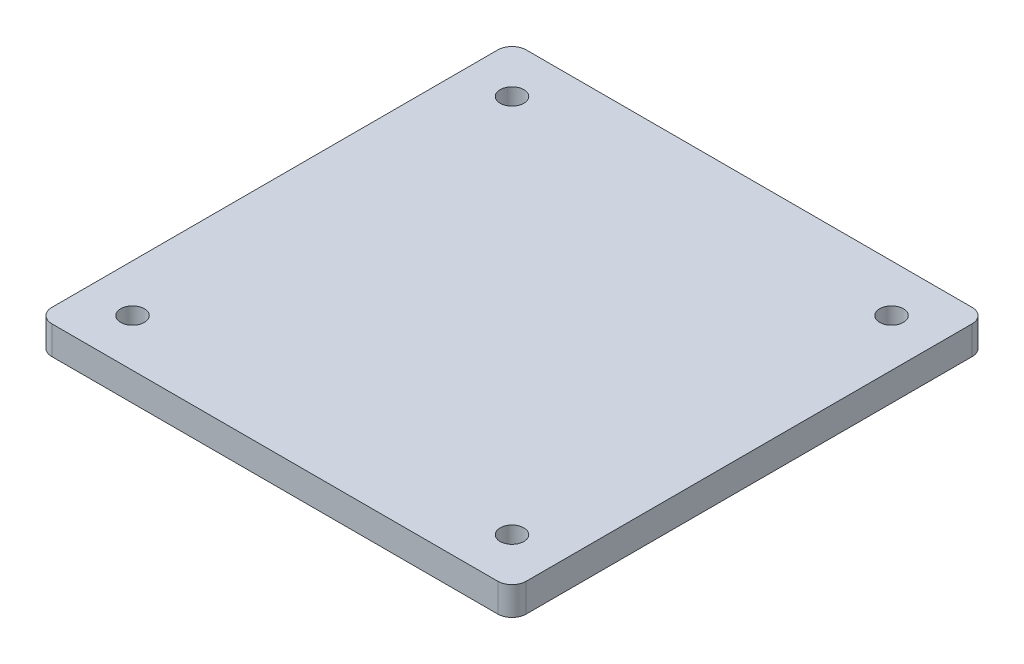
ISO-10303-21;
HEADER;
FILE_DESCRIPTION(('STEP AP214'),'2;1');
FILE_NAME('part.step','',(''),(''),'','','');
FILE_SCHEMA(('AUTOMOTIVE_DESIGN { 1 0 10303 214 1 1 1 1 }'));
ENDSEC;
DATA;
#1=APPLICATION_CONTEXT('core data for automotive mechanical design processes');
#2=APPLICATION_PROTOCOL_DEFINITION('international standard','automotive_design',2000,#1);
#3=PRODUCT_CONTEXT('',#1,'mechanical');
#4=PRODUCT('Part','Part','',(#3));
#5=PRODUCT_RELATED_PRODUCT_CATEGORY('part','',(#4));
#6=PRODUCT_DEFINITION_FORMATION('','',#4);
#7=PRODUCT_DEFINITION_CONTEXT('part definition',#1,'design');
#8=PRODUCT_DEFINITION('design','',#6,#7);
#9=PRODUCT_DEFINITION_SHAPE('','',#8);
#10=(LENGTH_UNIT() NAMED_UNIT(*) SI_UNIT(.MILLI.,.METRE.));
#11=(NAMED_UNIT(*) PLANE_ANGLE_UNIT() SI_UNIT($,.RADIAN.));
#12=(NAMED_UNIT(*) SI_UNIT($,.STERADIAN.) SOLID_ANGLE_UNIT());
#13=UNCERTAINTY_MEASURE_WITH_UNIT(LENGTH_MEASURE(1.E-05),#10,'distance_accuracy_value','');
#14=(GEOMETRIC_REPRESENTATION_CONTEXT(3) GLOBAL_UNCERTAINTY_ASSIGNED_CONTEXT((#13)) GLOBAL_UNIT_ASSIGNED_CONTEXT((#10,
#11,#12)) REPRESENTATION_CONTEXT('',''));
#15=CARTESIAN_POINT('',(0.,0.,0.));
#16=DIRECTION('',(0.,0.,1.));
#17=DIRECTION('',(1.,0.,0.));
#18=AXIS2_PLACEMENT_3D('',#15,#16,#17);
#19=CARTESIAN_POINT('',(0.,6.,0.));
#20=DIRECTION('',(0.,1.,0.));
#21=DIRECTION('',(0.,0.,1.));
#22=AXIS2_PLACEMENT_3D('',#19,#20,#21);
#23=PLANE('',#22);
#24=CARTESIAN_POINT('',(80.0000000000009,6.,80.));
#25=DIRECTION('',(0.,1.,0.));
#26=DIRECTION('',(0.,0.,1.));
#27=AXIS2_PLACEMENT_3D('',#24,#25,#26);
#28=CIRCLE('',#27,2.50000000000001);
#29=CARTESIAN_POINT('',(80.0000000000009,6.,82.5));
#30=VERTEX_POINT('',#29);
#31=EDGE_CURVE('E185',#30,#30,#28,.T.);
#32=ORIENTED_EDGE('',*,*,#31,.F.);
#33=EDGE_LOOP('',(#32));
#34=FACE_BOUND('',#33,.T.);
#35=CARTESIAN_POINT('',(0.,6.,0.));
#36=DIRECTION('',(0.,1.,0.));
#37=DIRECTION('',(0.,0.,1.));
#38=AXIS2_PLACEMENT_3D('',#35,#36,#37);
#39=CIRCLE('',#38,2.5);
#40=CARTESIAN_POINT('',(0.,6.,2.5));
#41=VERTEX_POINT('',#40);
#42=EDGE_CURVE('E127',#41,#41,#39,.T.);
#43=ORIENTED_EDGE('',*,*,#42,.F.);
#44=EDGE_LOOP('',(#43));
#45=FACE_BOUND('',#44,.T.);
#46=DIRECTION('',(-1.,0.,0.));
#47=VECTOR('',#46,1.);
#48=CARTESIAN_POINT('',(-9.99999999999916,6.,-10.));
#49=LINE('',#48,#47);
#50=CARTESIAN_POINT('',(87.0000000000008,6.,-10.));
#51=VERTEX_POINT('',#50);
#52=CARTESIAN_POINT('',(-6.99999999999916,6.,-10.));
#53=VERTEX_POINT('',#52);
#54=EDGE_CURVE('E136',#51,#53,#49,.T.);
#55=ORIENTED_EDGE('',*,*,#54,.T.);
#56=CARTESIAN_POINT('',(-6.99999999999916,6.,-7.));
#57=DIRECTION('',(0.,1.,0.));
#58=DIRECTION('',(0.,0.,1.));
#59=AXIS2_PLACEMENT_3D('',#56,#57,#58);
#60=CIRCLE('',#59,3.);
#61=CARTESIAN_POINT('',(-9.99999999999916,6.,-7.));
#62=VERTEX_POINT('',#61);
#63=EDGE_CURVE('E155',#53,#62,#60,.T.);
#64=ORIENTED_EDGE('',*,*,#63,.T.);
#65=DIRECTION('',(0.,0.,1.));
#66=VECTOR('',#65,1.);
#67=CARTESIAN_POINT('',(-9.99999999999916,6.,-10.));
#68=LINE('',#67,#66);
#69=CARTESIAN_POINT('',(-9.99999999999916,6.,87.));
#70=VERTEX_POINT('',#69);
#71=EDGE_CURVE('E119',#62,#70,#68,.T.);
#72=ORIENTED_EDGE('',*,*,#71,.T.);
#73=CARTESIAN_POINT('',(-6.99999999999916,6.,87.));
#74=DIRECTION('',(0.,1.,0.));
#75=DIRECTION('',(0.,0.,1.));
#76=AXIS2_PLACEMENT_3D('',#73,#74,#75);
#77=CIRCLE('',#76,3.);
#78=CARTESIAN_POINT('',(-6.99999999999916,6.,90.));
#79=VERTEX_POINT('',#78);
#80=EDGE_CURVE('E153',#70,#79,#77,.T.);
#81=ORIENTED_EDGE('',*,*,#80,.T.);
#82=DIRECTION('',(1.,0.,0.));
#83=VECTOR('',#82,1.);
#84=CARTESIAN_POINT('',(-9.99999999999916,6.,90.));
#85=LINE('',#84,#83);
#86=CARTESIAN_POINT('',(87.0000000000009,6.,90.));
#87=VERTEX_POINT('',#86);
#88=EDGE_CURVE('E175',#79,#87,#85,.T.);
#89=ORIENTED_EDGE('',*,*,#88,.T.);
#90=CARTESIAN_POINT('',(87.0000000000009,6.,87.));
#91=DIRECTION('',(0.,1.,0.));
#92=DIRECTION('',(0.,0.,1.));
#93=AXIS2_PLACEMENT_3D('',#90,#91,#92);
#94=CIRCLE('',#93,3.);
#95=CARTESIAN_POINT('',(90.0000000000009,6.,87.));
#96=VERTEX_POINT('',#95);
#97=EDGE_CURVE('E54',#87,#96,#94,.T.);
#98=ORIENTED_EDGE('',*,*,#97,.T.);
#99=DIRECTION('',(0.,0.,-1.));
#100=VECTOR('',#99,1.);
#101=CARTESIAN_POINT('',(90.0000000000008,6.,-10.));
#102=LINE('',#101,#100);
#103=CARTESIAN_POINT('',(90.0000000000008,6.,-7.));
#104=VERTEX_POINT('',#103);
#105=EDGE_CURVE('E165',#96,#104,#102,.T.);
#106=ORIENTED_EDGE('',*,*,#105,.T.);
#107=CARTESIAN_POINT('',(87.0000000000008,6.,-7.));
#108=DIRECTION('',(0.,1.,0.));
#109=DIRECTION('',(0.,0.,1.));
#110=AXIS2_PLACEMENT_3D('',#107,#108,#109);
#111=CIRCLE('',#110,3.);
#112=EDGE_CURVE('E151',#104,#51,#111,.T.);
#113=ORIENTED_EDGE('',*,*,#112,.T.);
#114=EDGE_LOOP('',(#55,#64,#72,#81,#89,#98,#106,#113));
#115=FACE_BOUND('',#114,.T.);
#116=CARTESIAN_POINT('',(80.,6.,0.));
#117=DIRECTION('',(0.,1.,0.));
#118=DIRECTION('',(0.,0.,1.));
#119=AXIS2_PLACEMENT_3D('',#116,#117,#118);
#120=CIRCLE('',#119,2.50000000000001);
#121=CARTESIAN_POINT('',(80.,6.,2.50000000000001));
#122=VERTEX_POINT('',#121);
#123=EDGE_CURVE('E180',#122,#122,#120,.T.);
#124=ORIENTED_EDGE('',*,*,#123,.F.);
#125=EDGE_LOOP('',(#124));
#126=FACE_BOUND('',#125,.T.);
#127=CARTESIAN_POINT('',(8.37956007813608E-13,6.,80.));
#128=DIRECTION('',(0.,1.,0.));
#129=DIRECTION('',(0.,0.,1.));
#130=AXIS2_PLACEMENT_3D('',#127,#128,#129);
#131=CIRCLE('',#130,2.5);
#132=CARTESIAN_POINT('',(8.37956007813608E-13,6.,82.5));
#133=VERTEX_POINT('',#132);
#134=EDGE_CURVE('E191',#133,#133,#131,.T.);
#135=ORIENTED_EDGE('',*,*,#134,.F.);
#136=EDGE_LOOP('',(#135));
#137=FACE_BOUND('',#136,.T.);
#138=ADVANCED_FACE('F34',(#34,#45,#115,#126,#137),#23,.T.);
#139=CARTESIAN_POINT('',(0.,0.,0.));
#140=DIRECTION('',(0.,1.,0.));
#141=DIRECTION('',(0.,0.,1.));
#142=AXIS2_PLACEMENT_3D('',#139,#140,#141);
#143=PLANE('',#142);
#144=CARTESIAN_POINT('',(80.0000000000009,0.,80.));
#145=DIRECTION('',(0.,1.,0.));
#146=DIRECTION('',(0.,0.,1.));
#147=AXIS2_PLACEMENT_3D('',#144,#145,#146);
#148=CIRCLE('',#147,2.50000000000001);
#149=CARTESIAN_POINT('',(80.0000000000009,0.,82.5));
#150=VERTEX_POINT('',#149);
#151=EDGE_CURVE('E188',#150,#150,#148,.T.);
#152=ORIENTED_EDGE('',*,*,#151,.T.);
#153=EDGE_LOOP('',(#152));
#154=FACE_BOUND('',#153,.T.);
#155=CARTESIAN_POINT('',(0.,0.,0.));
#156=DIRECTION('',(0.,1.,0.));
#157=DIRECTION('',(0.,0.,1.));
#158=AXIS2_PLACEMENT_3D('',#155,#156,#157);
#159=CIRCLE('',#158,2.5);
#160=CARTESIAN_POINT('',(0.,0.,2.5));
#161=VERTEX_POINT('',#160);
#162=EDGE_CURVE('E133',#161,#161,#159,.T.);
#163=ORIENTED_EDGE('',*,*,#162,.T.);
#164=EDGE_LOOP('',(#163));
#165=FACE_BOUND('',#164,.T.);
#166=DIRECTION('',(0.,0.,1.));
#167=VECTOR('',#166,1.);
#168=CARTESIAN_POINT('',(-9.99999999999916,0.,-10.));
#169=LINE('',#168,#167);
#170=CARTESIAN_POINT('',(-9.99999999999916,0.,-7.));
#171=VERTEX_POINT('',#170);
#172=CARTESIAN_POINT('',(-9.99999999999916,0.,87.));
#173=VERTEX_POINT('',#172);
#174=EDGE_CURVE('E116',#171,#173,#169,.T.);
#175=ORIENTED_EDGE('',*,*,#174,.F.);
#176=CARTESIAN_POINT('',(-6.99999999999916,0.,-7.));
#177=DIRECTION('',(0.,1.,0.));
#178=DIRECTION('',(0.,0.,1.));
#179=AXIS2_PLACEMENT_3D('',#176,#177,#178);
#180=CIRCLE('',#179,3.);
#181=CARTESIAN_POINT('',(-6.99999999999916,0.,-10.));
#182=VERTEX_POINT('',#181);
#183=EDGE_CURVE('E99',#171,#182,#180,.F.);
#184=ORIENTED_EDGE('',*,*,#183,.T.);
#185=DIRECTION('',(-1.,0.,0.));
#186=VECTOR('',#185,1.);
#187=CARTESIAN_POINT('',(-9.99999999999916,0.,-10.));
#188=LINE('',#187,#186);
#189=CARTESIAN_POINT('',(87.0000000000008,0.,-10.));
#190=VERTEX_POINT('',#189);
#191=EDGE_CURVE('E140',#190,#182,#188,.T.);
#192=ORIENTED_EDGE('',*,*,#191,.F.);
#193=CARTESIAN_POINT('',(87.0000000000008,0.,-7.));
#194=DIRECTION('',(0.,1.,0.));
#195=DIRECTION('',(0.,0.,1.));
#196=AXIS2_PLACEMENT_3D('',#193,#194,#195);
#197=CIRCLE('',#196,3.);
#198=CARTESIAN_POINT('',(90.0000000000008,0.,-7.));
#199=VERTEX_POINT('',#198);
#200=EDGE_CURVE('E144',#190,#199,#197,.F.);
#201=ORIENTED_EDGE('',*,*,#200,.T.);
#202=DIRECTION('',(0.,0.,-1.));
#203=VECTOR('',#202,1.);
#204=CARTESIAN_POINT('',(90.0000000000008,0.,-10.));
#205=LINE('',#204,#203);
#206=CARTESIAN_POINT('',(90.0000000000009,0.,87.));
#207=VERTEX_POINT('',#206);
#208=EDGE_CURVE('E130',#207,#199,#205,.T.);
#209=ORIENTED_EDGE('',*,*,#208,.F.);
#210=CARTESIAN_POINT('',(87.0000000000009,0.,87.));
#211=DIRECTION('',(0.,1.,0.));
#212=DIRECTION('',(0.,0.,1.));
#213=AXIS2_PLACEMENT_3D('',#210,#211,#212);
#214=CIRCLE('',#213,3.);
#215=CARTESIAN_POINT('',(87.0000000000009,0.,90.));
#216=VERTEX_POINT('',#215);
#217=EDGE_CURVE('E120',#207,#216,#214,.F.);
#218=ORIENTED_EDGE('',*,*,#217,.T.);
#219=DIRECTION('',(1.,0.,0.));
#220=VECTOR('',#219,1.);
#221=CARTESIAN_POINT('',(-9.99999999999916,0.,90.));
#222=LINE('',#221,#220);
#223=CARTESIAN_POINT('',(-6.99999999999916,0.,90.));
#224=VERTEX_POINT('',#223);
#225=EDGE_CURVE('E126',#224,#216,#222,.T.);
#226=ORIENTED_EDGE('',*,*,#225,.F.);
#227=CARTESIAN_POINT('',(-6.99999999999916,0.,87.));
#228=DIRECTION('',(0.,1.,0.));
#229=DIRECTION('',(0.,0.,1.));
#230=AXIS2_PLACEMENT_3D('',#227,#228,#229);
#231=CIRCLE('',#230,3.);
#232=EDGE_CURVE('E110',#224,#173,#231,.F.);
#233=ORIENTED_EDGE('',*,*,#232,.T.);
#234=EDGE_LOOP('',(#175,#184,#192,#201,#209,#218,#226,#233));
#235=FACE_BOUND('',#234,.T.);
#236=CARTESIAN_POINT('',(80.,0.,0.));
#237=DIRECTION('',(0.,1.,0.));
#238=DIRECTION('',(0.,0.,1.));
#239=AXIS2_PLACEMENT_3D('',#236,#237,#238);
#240=CIRCLE('',#239,2.50000000000001);
#241=CARTESIAN_POINT('',(80.,0.,2.50000000000001));
#242=VERTEX_POINT('',#241);
#243=EDGE_CURVE('E182',#242,#242,#240,.T.);
#244=ORIENTED_EDGE('',*,*,#243,.T.);
#245=EDGE_LOOP('',(#244));
#246=FACE_BOUND('',#245,.T.);
#247=CARTESIAN_POINT('',(8.37956007813608E-13,0.,80.));
#248=DIRECTION('',(0.,1.,0.));
#249=DIRECTION('',(0.,0.,1.));
#250=AXIS2_PLACEMENT_3D('',#247,#248,#249);
#251=CIRCLE('',#250,2.5);
#252=CARTESIAN_POINT('',(8.37956007813608E-13,0.,82.5));
#253=VERTEX_POINT('',#252);
#254=EDGE_CURVE('E194',#253,#253,#251,.T.);
#255=ORIENTED_EDGE('',*,*,#254,.T.);
#256=EDGE_LOOP('',(#255));
#257=FACE_BOUND('',#256,.T.);
#258=ADVANCED_FACE('F123',(#154,#165,#235,#246,#257),#143,.F.);
#259=CARTESIAN_POINT('',(-9.99999999999916,6.,-10.));
#260=DIRECTION('',(1.,0.,0.));
#261=DIRECTION('',(0.,0.,-1.));
#262=AXIS2_PLACEMENT_3D('',#259,#260,#261);
#263=PLANE('',#262);
#264=ORIENTED_EDGE('',*,*,#71,.F.);
#265=DIRECTION('',(0.,-1.,0.));
#266=VECTOR('',#265,1.);
#267=CARTESIAN_POINT('',(-9.99999999999916,6.,-7.));
#268=LINE('',#267,#266);
#269=EDGE_CURVE('E103',#62,#171,#268,.T.);
#270=ORIENTED_EDGE('',*,*,#269,.T.);
#271=ORIENTED_EDGE('',*,*,#174,.T.);
#272=DIRECTION('',(0.,-1.,0.));
#273=VECTOR('',#272,1.);
#274=CARTESIAN_POINT('',(-9.99999999999916,6.,87.));
#275=LINE('',#274,#273);
#276=EDGE_CURVE('E121',#173,#70,#275,.F.);
#277=ORIENTED_EDGE('',*,*,#276,.T.);
#278=EDGE_LOOP('',(#264,#270,#271,#277));
#279=FACE_BOUND('',#278,.T.);
#280=ADVANCED_FACE('F115',(#279),#263,.F.);
#281=CARTESIAN_POINT('',(-9.99999999999916,6.,90.));
#282=DIRECTION('',(0.,0.,-1.));
#283=DIRECTION('',(-1.,0.,0.));
#284=AXIS2_PLACEMENT_3D('',#281,#282,#283);
#285=PLANE('',#284);
#286=ORIENTED_EDGE('',*,*,#88,.F.);
#287=DIRECTION('',(0.,-1.,0.));
#288=VECTOR('',#287,1.);
#289=CARTESIAN_POINT('',(-6.99999999999916,6.,90.));
#290=LINE('',#289,#288);
#291=EDGE_CURVE('E159',#79,#224,#290,.T.);
#292=ORIENTED_EDGE('',*,*,#291,.T.);
#293=ORIENTED_EDGE('',*,*,#225,.T.);
#294=DIRECTION('',(0.,-1.,0.));
#295=VECTOR('',#294,1.);
#296=CARTESIAN_POINT('',(87.0000000000009,6.,90.));
#297=LINE('',#296,#295);
#298=EDGE_CURVE('E157',#216,#87,#297,.F.);
#299=ORIENTED_EDGE('',*,*,#298,.T.);
#300=EDGE_LOOP('',(#286,#292,#293,#299));
#301=FACE_BOUND('',#300,.T.);
#302=ADVANCED_FACE('F221',(#301),#285,.F.);
#303=CARTESIAN_POINT('',(90.0000000000008,6.,-10.));
#304=DIRECTION('',(-1.,0.,0.));
#305=DIRECTION('',(0.,0.,1.));
#306=AXIS2_PLACEMENT_3D('',#303,#304,#305);
#307=PLANE('',#306);
#308=ORIENTED_EDGE('',*,*,#208,.T.);
#309=DIRECTION('',(0.,-1.,0.));
#310=VECTOR('',#309,1.);
#311=CARTESIAN_POINT('',(90.0000000000008,6.,-7.));
#312=LINE('',#311,#310);
#313=EDGE_CURVE('E11',#199,#104,#312,.F.);
#314=ORIENTED_EDGE('',*,*,#313,.T.);
#315=ORIENTED_EDGE('',*,*,#105,.F.);
#316=DIRECTION('',(0.,-1.,0.));
#317=VECTOR('',#316,1.);
#318=CARTESIAN_POINT('',(90.0000000000009,6.,87.));
#319=LINE('',#318,#317);
#320=EDGE_CURVE('E42',#96,#207,#319,.T.);
#321=ORIENTED_EDGE('',*,*,#320,.T.);
#322=EDGE_LOOP('',(#308,#314,#315,#321));
#323=FACE_BOUND('',#322,.T.);
#324=ADVANCED_FACE('F164',(#323),#307,.F.);
#325=CARTESIAN_POINT('',(-9.99999999999916,6.,-10.));
#326=DIRECTION('',(0.,0.,1.));
#327=DIRECTION('',(1.,0.,0.));
#328=AXIS2_PLACEMENT_3D('',#325,#326,#327);
#329=PLANE('',#328);
#330=ORIENTED_EDGE('',*,*,#191,.T.);
#331=DIRECTION('',(0.,-1.,0.));
#332=VECTOR('',#331,1.);
#333=CARTESIAN_POINT('',(-6.99999999999916,6.,-10.));
#334=LINE('',#333,#332);
#335=EDGE_CURVE('E104',#182,#53,#334,.F.);
#336=ORIENTED_EDGE('',*,*,#335,.T.);
#337=ORIENTED_EDGE('',*,*,#54,.F.);
#338=DIRECTION('',(0.,-1.,0.));
#339=VECTOR('',#338,1.);
#340=CARTESIAN_POINT('',(87.0000000000008,6.,-10.));
#341=LINE('',#340,#339);
#342=EDGE_CURVE('E109',#51,#190,#341,.T.);
#343=ORIENTED_EDGE('',*,*,#342,.T.);
#344=EDGE_LOOP('',(#330,#336,#337,#343));
#345=FACE_BOUND('',#344,.T.);
#346=ADVANCED_FACE('F173',(#345),#329,.F.);
#347=CARTESIAN_POINT('',(0.,6.,0.));
#348=DIRECTION('',(0.,-1.,0.));
#349=DIRECTION('',(0.,0.,-1.));
#350=AXIS2_PLACEMENT_3D('',#347,#348,#349);
#351=CYLINDRICAL_SURFACE('',#350,2.5);
#352=ORIENTED_EDGE('',*,*,#42,.T.);
#353=EDGE_LOOP('',(#352));
#354=FACE_BOUND('',#353,.T.);
#355=ORIENTED_EDGE('',*,*,#162,.F.);
#356=EDGE_LOOP('',(#355));
#357=FACE_BOUND('',#356,.T.);
#358=ADVANCED_FACE('F214',(#354,#357),#351,.F.);
#359=CARTESIAN_POINT('',(80.,6.,0.));
#360=DIRECTION('',(0.,-1.,0.));
#361=DIRECTION('',(0.,0.,-1.));
#362=AXIS2_PLACEMENT_3D('',#359,#360,#361);
#363=CYLINDRICAL_SURFACE('',#362,2.50000000000001);
#364=ORIENTED_EDGE('',*,*,#123,.T.);
#365=EDGE_LOOP('',(#364));
#366=FACE_BOUND('',#365,.T.);
#367=ORIENTED_EDGE('',*,*,#243,.F.);
#368=EDGE_LOOP('',(#367));
#369=FACE_BOUND('',#368,.T.);
#370=ADVANCED_FACE('F245',(#366,#369),#363,.F.);
#371=CARTESIAN_POINT('',(80.0000000000009,6.,80.));
#372=DIRECTION('',(0.,-1.,0.));
#373=DIRECTION('',(0.,0.,-1.));
#374=AXIS2_PLACEMENT_3D('',#371,#372,#373);
#375=CYLINDRICAL_SURFACE('',#374,2.50000000000001);
#376=ORIENTED_EDGE('',*,*,#31,.T.);
#377=EDGE_LOOP('',(#376));
#378=FACE_BOUND('',#377,.T.);
#379=ORIENTED_EDGE('',*,*,#151,.F.);
#380=EDGE_LOOP('',(#379));
#381=FACE_BOUND('',#380,.T.);
#382=ADVANCED_FACE('F248',(#378,#381),#375,.F.);
#383=CARTESIAN_POINT('',(8.37956007813608E-13,6.,80.));
#384=DIRECTION('',(0.,-1.,0.));
#385=DIRECTION('',(0.,0.,-1.));
#386=AXIS2_PLACEMENT_3D('',#383,#384,#385);
#387=CYLINDRICAL_SURFACE('',#386,2.5);
#388=ORIENTED_EDGE('',*,*,#134,.T.);
#389=EDGE_LOOP('',(#388));
#390=FACE_BOUND('',#389,.T.);
#391=ORIENTED_EDGE('',*,*,#254,.F.);
#392=EDGE_LOOP('',(#391));
#393=FACE_BOUND('',#392,.T.);
#394=ADVANCED_FACE('F200',(#390,#393),#387,.F.);
#395=CARTESIAN_POINT('',(-6.99999999999916,6.,-7.));
#396=DIRECTION('',(0.,-1.,0.));
#397=DIRECTION('',(0.,0.,-1.));
#398=AXIS2_PLACEMENT_3D('',#395,#396,#397);
#399=CYLINDRICAL_SURFACE('',#398,3.);
#400=ORIENTED_EDGE('',*,*,#63,.F.);
#401=ORIENTED_EDGE('',*,*,#335,.F.);
#402=ORIENTED_EDGE('',*,*,#183,.F.);
#403=ORIENTED_EDGE('',*,*,#269,.F.);
#404=EDGE_LOOP('',(#400,#401,#402,#403));
#405=FACE_BOUND('',#404,.T.);
#406=ADVANCED_FACE('F102',(#405),#399,.T.);
#407=CARTESIAN_POINT('',(-6.99999999999916,6.,87.));
#408=DIRECTION('',(0.,-1.,0.));
#409=DIRECTION('',(0.,0.,-1.));
#410=AXIS2_PLACEMENT_3D('',#407,#408,#409);
#411=CYLINDRICAL_SURFACE('',#410,3.);
#412=ORIENTED_EDGE('',*,*,#80,.F.);
#413=ORIENTED_EDGE('',*,*,#276,.F.);
#414=ORIENTED_EDGE('',*,*,#232,.F.);
#415=ORIENTED_EDGE('',*,*,#291,.F.);
#416=EDGE_LOOP('',(#412,#413,#414,#415));
#417=FACE_BOUND('',#416,.T.);
#418=ADVANCED_FACE('F229',(#417),#411,.T.);
#419=CARTESIAN_POINT('',(87.0000000000008,6.,-7.));
#420=DIRECTION('',(0.,-1.,0.));
#421=DIRECTION('',(0.,0.,-1.));
#422=AXIS2_PLACEMENT_3D('',#419,#420,#421);
#423=CYLINDRICAL_SURFACE('',#422,3.);
#424=ORIENTED_EDGE('',*,*,#112,.F.);
#425=ORIENTED_EDGE('',*,*,#313,.F.);
#426=ORIENTED_EDGE('',*,*,#200,.F.);
#427=ORIENTED_EDGE('',*,*,#342,.F.);
#428=EDGE_LOOP('',(#424,#425,#426,#427));
#429=FACE_BOUND('',#428,.T.);
#430=ADVANCED_FACE('F170',(#429),#423,.T.);
#431=CARTESIAN_POINT('',(87.0000000000009,6.,87.));
#432=DIRECTION('',(0.,-1.,0.));
#433=DIRECTION('',(0.,0.,-1.));
#434=AXIS2_PLACEMENT_3D('',#431,#432,#433);
#435=CYLINDRICAL_SURFACE('',#434,3.);
#436=ORIENTED_EDGE('',*,*,#97,.F.);
#437=ORIENTED_EDGE('',*,*,#298,.F.);
#438=ORIENTED_EDGE('',*,*,#217,.F.);
#439=ORIENTED_EDGE('',*,*,#320,.F.);
#440=EDGE_LOOP('',(#436,#437,#438,#439));
#441=FACE_BOUND('',#440,.T.);
#442=ADVANCED_FACE('F36',(#441),#435,.T.);
#443=CLOSED_SHELL('',(#138,#258,#280,#302,#324,#346,#358,#370,#382,#394,#406,#418,#430,#442));
#444=MANIFOLD_SOLID_BREP('B2',#443);
#445=ADVANCED_BREP_SHAPE_REPRESENTATION('',(#18,#444),#14);
#446=SHAPE_DEFINITION_REPRESENTATION(#9,#445);
ENDSEC;
END-ISO-10303-21;
